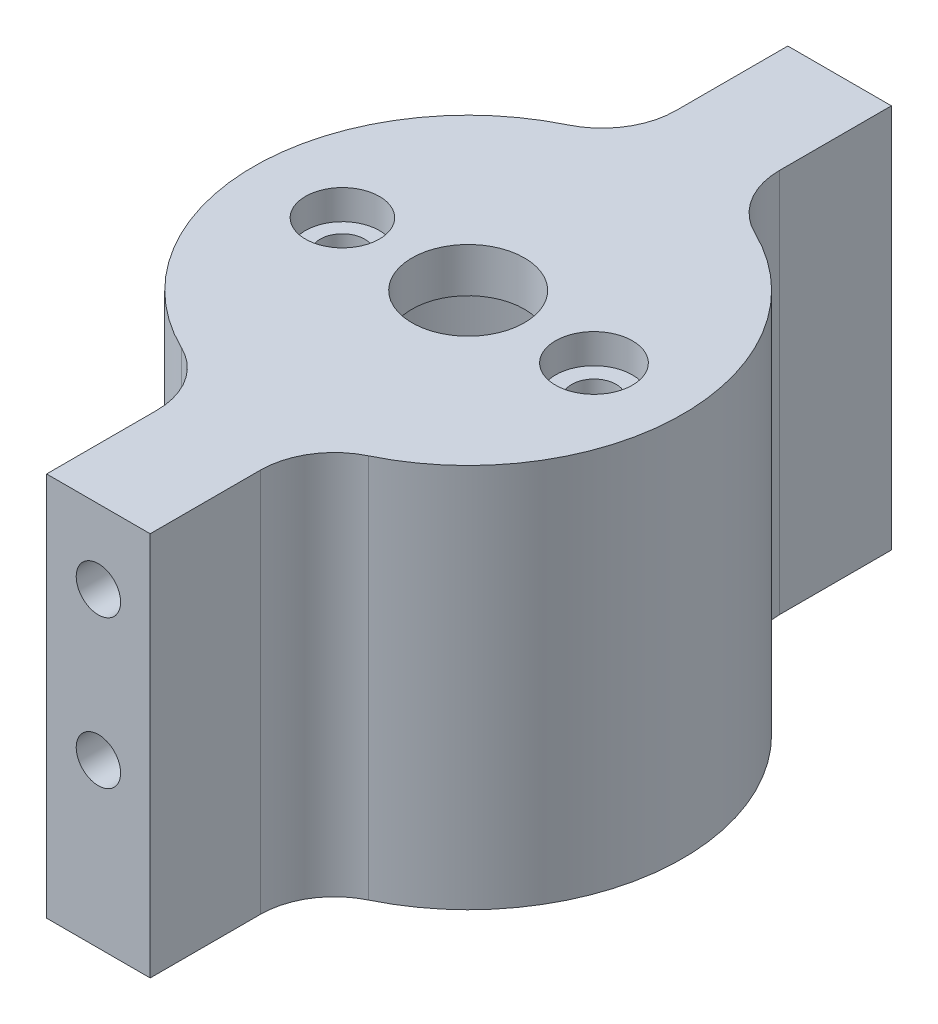
ISO-10303-21;
HEADER;
FILE_DESCRIPTION(('STEP AP214'),'2;1');
FILE_NAME('part.step','',(''),(''),'','','');
FILE_SCHEMA(('AUTOMOTIVE_DESIGN { 1 0 10303 214 1 1 1 1 }'));
ENDSEC;
DATA;
#1=APPLICATION_CONTEXT('core data for automotive mechanical design processes');
#2=APPLICATION_PROTOCOL_DEFINITION('international standard','automotive_design',2000,#1);
#3=PRODUCT_CONTEXT('',#1,'mechanical');
#4=PRODUCT('Part','Part','',(#3));
#5=PRODUCT_RELATED_PRODUCT_CATEGORY('part','',(#4));
#6=PRODUCT_DEFINITION_FORMATION('','',#4);
#7=PRODUCT_DEFINITION_CONTEXT('part definition',#1,'design');
#8=PRODUCT_DEFINITION('design','',#6,#7);
#9=PRODUCT_DEFINITION_SHAPE('','',#8);
#10=(LENGTH_UNIT() NAMED_UNIT(*) SI_UNIT(.MILLI.,.METRE.));
#11=(NAMED_UNIT(*) PLANE_ANGLE_UNIT() SI_UNIT($,.RADIAN.));
#12=(NAMED_UNIT(*) SI_UNIT($,.STERADIAN.) SOLID_ANGLE_UNIT());
#13=UNCERTAINTY_MEASURE_WITH_UNIT(LENGTH_MEASURE(1.E-05),#10,'distance_accuracy_value','');
#14=(GEOMETRIC_REPRESENTATION_CONTEXT(3) GLOBAL_UNCERTAINTY_ASSIGNED_CONTEXT((#13)) GLOBAL_UNIT_ASSIGNED_CONTEXT((#10,
#11,#12)) REPRESENTATION_CONTEXT('',''));
#15=CARTESIAN_POINT('',(0.,0.,0.));
#16=DIRECTION('',(0.,0.,1.));
#17=DIRECTION('',(1.,0.,0.));
#18=AXIS2_PLACEMENT_3D('',#15,#16,#17);
#19=CARTESIAN_POINT('',(0.,2.,0.));
#20=DIRECTION('',(0.,-1.,0.));
#21=DIRECTION('',(0.,0.,1.));
#22=AXIS2_PLACEMENT_3D('',#19,#20,#21);
#23=CYLINDRICAL_SURFACE('',#22,14.5);
#24=CARTESIAN_POINT('',(0.,-23.,0.));
#25=DIRECTION('',(0.,1.,0.));
#26=DIRECTION('',(0.,0.,1.));
#27=AXIS2_PLACEMENT_3D('',#24,#25,#26);
#28=CIRCLE('',#27,14.5);
#29=CARTESIAN_POINT('',(6.32051282051282,-23.,13.0499470376601));
#30=VERTEX_POINT('',#29);
#31=CARTESIAN_POINT('',(6.32051282051281,-23.,-13.0499470376601));
#32=VERTEX_POINT('',#31);
#33=EDGE_CURVE('E214',#30,#32,#28,.T.);
#34=ORIENTED_EDGE('',*,*,#33,.T.);
#35=DIRECTION('',(0.,-1.,0.));
#36=VECTOR('',#35,1.);
#37=CARTESIAN_POINT('',(6.32051282051281,2.,-13.0499470376601));
#38=LINE('',#37,#36);
#39=CARTESIAN_POINT('',(6.32051282051281,3.,-13.0499470376601));
#40=VERTEX_POINT('',#39);
#41=EDGE_CURVE('E247',#40,#32,#38,.T.);
#42=ORIENTED_EDGE('',*,*,#41,.F.);
#43=CARTESIAN_POINT('',(0.,3.,0.));
#44=DIRECTION('',(0.,-1.,0.));
#45=DIRECTION('',(0.,0.,-1.));
#46=AXIS2_PLACEMENT_3D('',#43,#44,#45);
#47=CIRCLE('',#46,14.5);
#48=CARTESIAN_POINT('',(6.32051282051282,3.,13.0499470376601));
#49=VERTEX_POINT('',#48);
#50=EDGE_CURVE('E209',#40,#49,#47,.T.);
#51=ORIENTED_EDGE('',*,*,#50,.T.);
#52=DIRECTION('',(0.,-1.,0.));
#53=VECTOR('',#52,1.);
#54=CARTESIAN_POINT('',(6.32051282051282,2.,13.0499470376601));
#55=LINE('',#54,#53);
#56=EDGE_CURVE('E250',#30,#49,#55,.F.);
#57=ORIENTED_EDGE('',*,*,#56,.F.);
#58=EDGE_LOOP('',(#34,#42,#51,#57));
#59=FACE_BOUND('',#58,.T.);
#60=ADVANCED_FACE('F41',(#59),#23,.T.);
#61=CARTESIAN_POINT('',(-8.5,-0.5,0.));
#62=DIRECTION('',(0.,1.,0.));
#63=DIRECTION('',(0.,0.,-1.));
#64=AXIS2_PLACEMENT_3D('',#61,#62,#63);
#65=CYLINDRICAL_SURFACE('',#64,1.5);
#66=CARTESIAN_POINT('',(-8.5,0.,0.));
#67=DIRECTION('',(0.,-1.,0.));
#68=DIRECTION('',(0.,0.,-1.));
#69=AXIS2_PLACEMENT_3D('',#66,#67,#68);
#70=CIRCLE('',#69,1.5);
#71=CARTESIAN_POINT('',(-8.5,0.,-1.5));
#72=VERTEX_POINT('',#71);
#73=EDGE_CURVE('E227',#72,#72,#70,.T.);
#74=ORIENTED_EDGE('',*,*,#73,.T.);
#75=EDGE_LOOP('',(#74));
#76=FACE_BOUND('',#75,.T.);
#77=CARTESIAN_POINT('',(-8.5,1.,0.));
#78=DIRECTION('',(0.,-1.,0.));
#79=DIRECTION('',(0.,0.,-1.));
#80=AXIS2_PLACEMENT_3D('',#77,#78,#79);
#81=CIRCLE('',#80,1.5);
#82=CARTESIAN_POINT('',(-8.5,1.,-1.5));
#83=VERTEX_POINT('',#82);
#84=EDGE_CURVE('E210',#83,#83,#81,.F.);
#85=ORIENTED_EDGE('',*,*,#84,.T.);
#86=EDGE_LOOP('',(#85));
#87=FACE_BOUND('',#86,.T.);
#88=ADVANCED_FACE('F336',(#76,#87),#65,.F.);
#89=CARTESIAN_POINT('',(8.5,-0.5,0.));
#90=DIRECTION('',(0.,1.,0.));
#91=DIRECTION('',(0.,0.,-1.));
#92=AXIS2_PLACEMENT_3D('',#89,#90,#91);
#93=CYLINDRICAL_SURFACE('',#92,1.5);
#94=CARTESIAN_POINT('',(8.5,0.,0.));
#95=DIRECTION('',(0.,-1.,0.));
#96=DIRECTION('',(0.,0.,-1.));
#97=AXIS2_PLACEMENT_3D('',#94,#95,#96);
#98=CIRCLE('',#97,1.5);
#99=CARTESIAN_POINT('',(8.5,0.,-1.5));
#100=VERTEX_POINT('',#99);
#101=EDGE_CURVE('E230',#100,#100,#98,.T.);
#102=ORIENTED_EDGE('',*,*,#101,.T.);
#103=EDGE_LOOP('',(#102));
#104=FACE_BOUND('',#103,.T.);
#105=CARTESIAN_POINT('',(8.5,1.,0.));
#106=DIRECTION('',(0.,-1.,0.));
#107=DIRECTION('',(0.,0.,-1.));
#108=AXIS2_PLACEMENT_3D('',#105,#106,#107);
#109=CIRCLE('',#108,1.5);
#110=CARTESIAN_POINT('',(8.5,1.,-1.5));
#111=VERTEX_POINT('',#110);
#112=EDGE_CURVE('E197',#111,#111,#109,.F.);
#113=ORIENTED_EDGE('',*,*,#112,.T.);
#114=EDGE_LOOP('',(#113));
#115=FACE_BOUND('',#114,.T.);
#116=ADVANCED_FACE('F341',(#104,#115),#93,.F.);
#117=CARTESIAN_POINT('',(0.,0.,0.));
#118=DIRECTION('',(0.,1.,0.));
#119=DIRECTION('',(0.,0.,-1.));
#120=AXIS2_PLACEMENT_3D('',#117,#118,#119);
#121=PLANE('',#120);
#122=CARTESIAN_POINT('',(0.,0.,0.));
#123=DIRECTION('',(0.,-1.,0.));
#124=DIRECTION('',(0.,0.,-1.));
#125=AXIS2_PLACEMENT_3D('',#122,#123,#124);
#126=CIRCLE('',#125,3.8);
#127=CARTESIAN_POINT('',(0.,0.,-3.8));
#128=VERTEX_POINT('',#127);
#129=EDGE_CURVE('E224',#128,#128,#126,.T.);
#130=ORIENTED_EDGE('',*,*,#129,.F.);
#131=EDGE_LOOP('',(#130));
#132=FACE_BOUND('',#131,.T.);
#133=ORIENTED_EDGE('',*,*,#73,.F.);
#134=EDGE_LOOP('',(#133));
#135=FACE_BOUND('',#134,.T.);
#136=ORIENTED_EDGE('',*,*,#101,.F.);
#137=EDGE_LOOP('',(#136));
#138=FACE_BOUND('',#137,.T.);
#139=CARTESIAN_POINT('',(0.,0.,0.));
#140=DIRECTION('',(0.,1.,0.));
#141=DIRECTION('',(0.,0.,1.));
#142=AXIS2_PLACEMENT_3D('',#139,#140,#141);
#143=CIRCLE('',#142,12.5);
#144=CARTESIAN_POINT('',(0.,0.,12.5));
#145=VERTEX_POINT('',#144);
#146=EDGE_CURVE('E217',#145,#145,#143,.T.);
#147=ORIENTED_EDGE('',*,*,#146,.F.);
#148=EDGE_LOOP('',(#147));
#149=FACE_BOUND('',#148,.T.);
#150=ADVANCED_FACE('F347',(#132,#135,#138,#149),#121,.F.);
#151=CARTESIAN_POINT('',(-6.32051282051282,3.,13.0499470376601));
#152=VERTEX_POINT('',#151);
#153=CARTESIAN_POINT('',(-6.32051282051282,3.,-13.0499470376601));
#154=VERTEX_POINT('',#153);
#155=EDGE_CURVE('E213',#152,#154,#47,.T.);
#156=ORIENTED_EDGE('',*,*,#155,.T.);
#157=DIRECTION('',(0.,-1.,0.));
#158=VECTOR('',#157,1.);
#159=CARTESIAN_POINT('',(-6.32051282051282,2.,-13.0499470376601));
#160=LINE('',#159,#158);
#161=CARTESIAN_POINT('',(-6.32051282051282,-23.,-13.0499470376601));
#162=VERTEX_POINT('',#161);
#163=EDGE_CURVE('E233',#162,#154,#160,.F.);
#164=ORIENTED_EDGE('',*,*,#163,.F.);
#165=CARTESIAN_POINT('',(-6.32051282051282,-23.,13.0499470376601));
#166=VERTEX_POINT('',#165);
#167=EDGE_CURVE('E218',#162,#166,#28,.T.);
#168=ORIENTED_EDGE('',*,*,#167,.T.);
#169=DIRECTION('',(0.,-1.,0.));
#170=VECTOR('',#169,1.);
#171=CARTESIAN_POINT('',(-6.32051282051282,2.,13.0499470376601));
#172=LINE('',#171,#170);
#173=EDGE_CURVE('E240',#152,#166,#172,.T.);
#174=ORIENTED_EDGE('',*,*,#173,.F.);
#175=EDGE_LOOP('',(#156,#164,#168,#174));
#176=FACE_BOUND('',#175,.T.);
#177=ADVANCED_FACE('F281',(#176),#23,.T.);
#178=CARTESIAN_POINT('',(0.,-0.5,0.));
#179=DIRECTION('',(0.,1.,0.));
#180=DIRECTION('',(0.,0.,-1.));
#181=AXIS2_PLACEMENT_3D('',#178,#179,#180);
#182=CYLINDRICAL_SURFACE('',#181,3.8);
#183=ORIENTED_EDGE('',*,*,#129,.T.);
#184=EDGE_LOOP('',(#183));
#185=FACE_BOUND('',#184,.T.);
#186=CARTESIAN_POINT('',(0.,3.,0.));
#187=DIRECTION('',(0.,-1.,0.));
#188=DIRECTION('',(0.,0.,-1.));
#189=AXIS2_PLACEMENT_3D('',#186,#187,#188);
#190=CIRCLE('',#189,3.8);
#191=CARTESIAN_POINT('',(0.,3.,-3.8));
#192=VERTEX_POINT('',#191);
#193=EDGE_CURVE('E206',#192,#192,#190,.T.);
#194=ORIENTED_EDGE('',*,*,#193,.F.);
#195=EDGE_LOOP('',(#194));
#196=FACE_BOUND('',#195,.T.);
#197=ADVANCED_FACE('F346',(#185,#196),#182,.F.);
#198=CARTESIAN_POINT('',(0.,-23.,0.));
#199=DIRECTION('',(0.,-1.,0.));
#200=DIRECTION('',(0.,0.,1.));
#201=AXIS2_PLACEMENT_3D('',#198,#199,#200);
#202=PLANE('',#201);
#203=DIRECTION('',(-1.,0.,0.));
#204=VECTOR('',#203,1.);
#205=CARTESIAN_POINT('',(3.5,-23.,24.99));
#206=LINE('',#205,#204);
#207=CARTESIAN_POINT('',(3.5,-23.,24.99));
#208=VERTEX_POINT('',#207);
#209=CARTESIAN_POINT('',(-3.49999999999999,-23.,24.99));
#210=VERTEX_POINT('',#209);
#211=EDGE_CURVE('E163',#208,#210,#206,.T.);
#212=ORIENTED_EDGE('',*,*,#211,.T.);
#213=DIRECTION('',(0.,0.,1.));
#214=VECTOR('',#213,1.);
#215=CARTESIAN_POINT('',(-3.5,-23.,25.1));
#216=LINE('',#215,#214);
#217=CARTESIAN_POINT('',(-3.5,-23.,17.5499287747842));
#218=VERTEX_POINT('',#217);
#219=EDGE_CURVE('E181',#218,#210,#216,.T.);
#220=ORIENTED_EDGE('',*,*,#219,.F.);
#221=CARTESIAN_POINT('',(-8.49999999999999,-23.,17.5499287747842));
#222=DIRECTION('',(0.,1.,0.));
#223=DIRECTION('',(0.,0.,1.));
#224=AXIS2_PLACEMENT_3D('',#221,#222,#223);
#225=CIRCLE('',#224,5.);
#226=EDGE_CURVE('E256',#166,#218,#225,.F.);
#227=ORIENTED_EDGE('',*,*,#226,.F.);
#228=ORIENTED_EDGE('',*,*,#167,.F.);
#229=CARTESIAN_POINT('',(-8.49999999999999,-23.,-17.5499287747842));
#230=DIRECTION('',(0.,1.,0.));
#231=DIRECTION('',(0.,0.,1.));
#232=AXIS2_PLACEMENT_3D('',#229,#230,#231);
#233=CIRCLE('',#232,5.);
#234=CARTESIAN_POINT('',(-3.5,-23.,-17.5499287747842));
#235=VERTEX_POINT('',#234);
#236=EDGE_CURVE('E49',#235,#162,#233,.F.);
#237=ORIENTED_EDGE('',*,*,#236,.F.);
#238=DIRECTION('',(0.,0.,1.));
#239=VECTOR('',#238,1.);
#240=CARTESIAN_POINT('',(-3.5,-23.,-25.1));
#241=LINE('',#240,#239);
#242=CARTESIAN_POINT('',(-3.5,-23.,-25.1));
#243=VERTEX_POINT('',#242);
#244=EDGE_CURVE('E156',#243,#235,#241,.T.);
#245=ORIENTED_EDGE('',*,*,#244,.F.);
#246=DIRECTION('',(-1.,0.,0.));
#247=VECTOR('',#246,1.);
#248=CARTESIAN_POINT('',(3.5,-23.,-25.1));
#249=LINE('',#248,#247);
#250=CARTESIAN_POINT('',(3.5,-23.,-25.1));
#251=VERTEX_POINT('',#250);
#252=EDGE_CURVE('E133',#251,#243,#249,.T.);
#253=ORIENTED_EDGE('',*,*,#252,.F.);
#254=DIRECTION('',(0.,0.,1.));
#255=VECTOR('',#254,1.);
#256=CARTESIAN_POINT('',(3.5,-23.,-25.1));
#257=LINE('',#256,#255);
#258=CARTESIAN_POINT('',(3.49999999999998,-23.,-17.5499287747843));
#259=VERTEX_POINT('',#258);
#260=EDGE_CURVE('E153',#251,#259,#257,.T.);
#261=ORIENTED_EDGE('',*,*,#260,.T.);
#262=CARTESIAN_POINT('',(8.49999999999998,-23.,-17.5499287747842));
#263=DIRECTION('',(0.,1.,0.));
#264=DIRECTION('',(0.,0.,1.));
#265=AXIS2_PLACEMENT_3D('',#262,#263,#264);
#266=CIRCLE('',#265,5.);
#267=EDGE_CURVE('E266',#32,#259,#266,.F.);
#268=ORIENTED_EDGE('',*,*,#267,.F.);
#269=ORIENTED_EDGE('',*,*,#33,.F.);
#270=CARTESIAN_POINT('',(8.49999999999999,-23.,17.5499287747842));
#271=DIRECTION('',(0.,1.,0.));
#272=DIRECTION('',(0.,0.,1.));
#273=AXIS2_PLACEMENT_3D('',#270,#271,#272);
#274=CIRCLE('',#273,5.);
#275=CARTESIAN_POINT('',(3.5,-23.,17.5499287747842));
#276=VERTEX_POINT('',#275);
#277=EDGE_CURVE('E261',#276,#30,#274,.F.);
#278=ORIENTED_EDGE('',*,*,#277,.F.);
#279=DIRECTION('',(0.,0.,-1.));
#280=VECTOR('',#279,1.);
#281=CARTESIAN_POINT('',(3.5,-23.,25.1));
#282=LINE('',#281,#280);
#283=EDGE_CURVE('E186',#208,#276,#282,.T.);
#284=ORIENTED_EDGE('',*,*,#283,.F.);
#285=EDGE_LOOP('',(#212,#220,#227,#228,#237,#245,#253,#261,#268,#269,#278,#284));
#286=FACE_BOUND('',#285,.T.);
#287=CARTESIAN_POINT('',(0.,-23.,0.));
#288=DIRECTION('',(0.,1.,0.));
#289=DIRECTION('',(0.,0.,1.));
#290=AXIS2_PLACEMENT_3D('',#287,#288,#289);
#291=CIRCLE('',#290,12.5);
#292=CARTESIAN_POINT('',(0.,-23.,12.5));
#293=VERTEX_POINT('',#292);
#294=EDGE_CURVE('E221',#293,#293,#291,.T.);
#295=ORIENTED_EDGE('',*,*,#294,.T.);
#296=EDGE_LOOP('',(#295));
#297=FACE_BOUND('',#296,.T.);
#298=ADVANCED_FACE('F276',(#286,#297),#202,.T.);
#299=CARTESIAN_POINT('',(0.,-23.,0.));
#300=DIRECTION('',(0.,1.,0.));
#301=DIRECTION('',(0.,0.,-1.));
#302=AXIS2_PLACEMENT_3D('',#299,#300,#301);
#303=CYLINDRICAL_SURFACE('',#302,12.5);
#304=ORIENTED_EDGE('',*,*,#294,.F.);
#305=EDGE_LOOP('',(#304));
#306=FACE_BOUND('',#305,.T.);
#307=ORIENTED_EDGE('',*,*,#146,.T.);
#308=EDGE_LOOP('',(#307));
#309=FACE_BOUND('',#308,.T.);
#310=ADVANCED_FACE('F365',(#306,#309),#303,.F.);
#311=CARTESIAN_POINT('',(0.,3.,0.));
#312=DIRECTION('',(0.,1.,0.));
#313=DIRECTION('',(0.,0.,-1.));
#314=AXIS2_PLACEMENT_3D('',#311,#312,#313);
#315=PLANE('',#314);
#316=DIRECTION('',(-1.,0.,0.));
#317=VECTOR('',#316,1.);
#318=CARTESIAN_POINT('',(3.5,3.00000000000001,24.99));
#319=LINE('',#318,#317);
#320=CARTESIAN_POINT('',(3.5,3.00000000000001,24.99));
#321=VERTEX_POINT('',#320);
#322=CARTESIAN_POINT('',(-3.49999999999999,3.00000000000001,24.99));
#323=VERTEX_POINT('',#322);
#324=EDGE_CURVE('E176',#321,#323,#319,.T.);
#325=ORIENTED_EDGE('',*,*,#324,.F.);
#326=DIRECTION('',(0.,0.,-1.));
#327=VECTOR('',#326,1.);
#328=CARTESIAN_POINT('',(3.5,3.00000000000001,25.1));
#329=LINE('',#328,#327);
#330=CARTESIAN_POINT('',(3.5,3.00000000000001,17.5499287747842));
#331=VERTEX_POINT('',#330);
#332=EDGE_CURVE('E185',#321,#331,#329,.T.);
#333=ORIENTED_EDGE('',*,*,#332,.T.);
#334=CARTESIAN_POINT('',(8.49999999999999,3.,17.5499287747842));
#335=DIRECTION('',(0.,-1.,0.));
#336=DIRECTION('',(0.,0.,-1.));
#337=AXIS2_PLACEMENT_3D('',#334,#335,#336);
#338=CIRCLE('',#337,5.);
#339=EDGE_CURVE('E263',#49,#331,#338,.F.);
#340=ORIENTED_EDGE('',*,*,#339,.F.);
#341=ORIENTED_EDGE('',*,*,#50,.F.);
#342=CARTESIAN_POINT('',(8.49999999999998,3.,-17.5499287747842));
#343=DIRECTION('',(0.,-1.,0.));
#344=DIRECTION('',(0.,0.,-1.));
#345=AXIS2_PLACEMENT_3D('',#342,#343,#344);
#346=CIRCLE('',#345,5.);
#347=CARTESIAN_POINT('',(3.49999999999998,3.00000000000001,-17.5499287747843));
#348=VERTEX_POINT('',#347);
#349=EDGE_CURVE('E269',#348,#40,#346,.F.);
#350=ORIENTED_EDGE('',*,*,#349,.F.);
#351=DIRECTION('',(0.,0.,1.));
#352=VECTOR('',#351,1.);
#353=CARTESIAN_POINT('',(3.5,3.00000000000001,-25.1));
#354=LINE('',#353,#352);
#355=CARTESIAN_POINT('',(3.5,3.00000000000001,-25.1));
#356=VERTEX_POINT('',#355);
#357=EDGE_CURVE('E142',#356,#348,#354,.T.);
#358=ORIENTED_EDGE('',*,*,#357,.F.);
#359=DIRECTION('',(-1.,0.,0.));
#360=VECTOR('',#359,1.);
#361=CARTESIAN_POINT('',(3.5,3.00000000000001,-25.1));
#362=LINE('',#361,#360);
#363=CARTESIAN_POINT('',(-3.5,3.00000000000001,-25.1));
#364=VERTEX_POINT('',#363);
#365=EDGE_CURVE('E130',#356,#364,#362,.T.);
#366=ORIENTED_EDGE('',*,*,#365,.T.);
#367=DIRECTION('',(0.,0.,1.));
#368=VECTOR('',#367,1.);
#369=CARTESIAN_POINT('',(-3.5,3.00000000000001,-25.1));
#370=LINE('',#369,#368);
#371=CARTESIAN_POINT('',(-3.5,3.00000000000001,-17.5499287747842));
#372=VERTEX_POINT('',#371);
#373=EDGE_CURVE('E139',#364,#372,#370,.T.);
#374=ORIENTED_EDGE('',*,*,#373,.T.);
#375=CARTESIAN_POINT('',(-8.49999999999999,3.,-17.5499287747842));
#376=DIRECTION('',(0.,-1.,0.));
#377=DIRECTION('',(0.,0.,-1.));
#378=AXIS2_PLACEMENT_3D('',#375,#376,#377);
#379=CIRCLE('',#378,5.);
#380=EDGE_CURVE('E11',#154,#372,#379,.F.);
#381=ORIENTED_EDGE('',*,*,#380,.F.);
#382=ORIENTED_EDGE('',*,*,#155,.F.);
#383=CARTESIAN_POINT('',(-8.49999999999999,3.,17.5499287747842));
#384=DIRECTION('',(0.,-1.,0.));
#385=DIRECTION('',(0.,0.,-1.));
#386=AXIS2_PLACEMENT_3D('',#383,#384,#385);
#387=CIRCLE('',#386,5.);
#388=CARTESIAN_POINT('',(-3.5,3.00000000000001,17.5499287747842));
#389=VERTEX_POINT('',#388);
#390=EDGE_CURVE('E259',#389,#152,#387,.F.);
#391=ORIENTED_EDGE('',*,*,#390,.F.);
#392=DIRECTION('',(0.,0.,1.));
#393=VECTOR('',#392,1.);
#394=CARTESIAN_POINT('',(-3.5,3.00000000000001,25.1));
#395=LINE('',#394,#393);
#396=EDGE_CURVE('E182',#389,#323,#395,.T.);
#397=ORIENTED_EDGE('',*,*,#396,.T.);
#398=EDGE_LOOP('',(#325,#333,#340,#341,#350,#358,#366,#374,#381,#382,#391,#397));
#399=FACE_BOUND('',#398,.T.);
#400=CARTESIAN_POINT('',(8.5,3.,0.));
#401=DIRECTION('',(0.,-1.,0.));
#402=DIRECTION('',(0.,0.,-1.));
#403=AXIS2_PLACEMENT_3D('',#400,#401,#402);
#404=CIRCLE('',#403,2.6);
#405=CARTESIAN_POINT('',(8.5,3.,-2.6));
#406=VERTEX_POINT('',#405);
#407=EDGE_CURVE('E198',#406,#406,#404,.T.);
#408=ORIENTED_EDGE('',*,*,#407,.T.);
#409=EDGE_LOOP('',(#408));
#410=FACE_BOUND('',#409,.T.);
#411=CARTESIAN_POINT('',(-8.5,3.,0.));
#412=DIRECTION('',(0.,-1.,0.));
#413=DIRECTION('',(0.,0.,-1.));
#414=AXIS2_PLACEMENT_3D('',#411,#412,#413);
#415=CIRCLE('',#414,2.5);
#416=CARTESIAN_POINT('',(-8.5,3.,-2.5));
#417=VERTEX_POINT('',#416);
#418=EDGE_CURVE('E201',#417,#417,#415,.T.);
#419=ORIENTED_EDGE('',*,*,#418,.T.);
#420=EDGE_LOOP('',(#419));
#421=FACE_BOUND('',#420,.T.);
#422=ORIENTED_EDGE('',*,*,#193,.T.);
#423=EDGE_LOOP('',(#422));
#424=FACE_BOUND('',#423,.T.);
#425=ADVANCED_FACE('F145',(#399,#410,#421,#424),#315,.T.);
#426=CARTESIAN_POINT('',(-8.5,1.,0.));
#427=DIRECTION('',(0.,1.,0.));
#428=DIRECTION('',(0.,0.,-1.));
#429=AXIS2_PLACEMENT_3D('',#426,#427,#428);
#430=PLANE('',#429);
#431=CARTESIAN_POINT('',(-8.5,1.,0.));
#432=DIRECTION('',(0.,-1.,0.));
#433=DIRECTION('',(0.,0.,-1.));
#434=AXIS2_PLACEMENT_3D('',#431,#432,#433);
#435=CIRCLE('',#434,2.5);
#436=CARTESIAN_POINT('',(-8.5,1.,-2.5));
#437=VERTEX_POINT('',#436);
#438=EDGE_CURVE('E189',#437,#437,#435,.T.);
#439=ORIENTED_EDGE('',*,*,#438,.F.);
#440=EDGE_LOOP('',(#439));
#441=FACE_BOUND('',#440,.T.);
#442=ORIENTED_EDGE('',*,*,#84,.F.);
#443=EDGE_LOOP('',(#442));
#444=FACE_BOUND('',#443,.T.);
#445=ADVANCED_FACE('F371',(#441,#444),#430,.T.);
#446=CARTESIAN_POINT('',(-8.5,1.,0.));
#447=DIRECTION('',(0.,1.,0.));
#448=DIRECTION('',(0.,0.,-1.));
#449=AXIS2_PLACEMENT_3D('',#446,#447,#448);
#450=CYLINDRICAL_SURFACE('',#449,2.5);
#451=ORIENTED_EDGE('',*,*,#438,.T.);
#452=EDGE_LOOP('',(#451));
#453=FACE_BOUND('',#452,.T.);
#454=ORIENTED_EDGE('',*,*,#418,.F.);
#455=EDGE_LOOP('',(#454));
#456=FACE_BOUND('',#455,.T.);
#457=ADVANCED_FACE('F374',(#453,#456),#450,.F.);
#458=CARTESIAN_POINT('',(8.5,1.,0.));
#459=DIRECTION('',(0.,1.,0.));
#460=DIRECTION('',(0.,0.,-1.));
#461=AXIS2_PLACEMENT_3D('',#458,#459,#460);
#462=PLANE('',#461);
#463=CARTESIAN_POINT('',(8.5,1.,0.));
#464=DIRECTION('',(0.,-1.,0.));
#465=DIRECTION('',(0.,0.,-1.));
#466=AXIS2_PLACEMENT_3D('',#463,#464,#465);
#467=CIRCLE('',#466,2.6);
#468=CARTESIAN_POINT('',(8.5,1.,-2.6));
#469=VERTEX_POINT('',#468);
#470=EDGE_CURVE('E194',#469,#469,#467,.T.);
#471=ORIENTED_EDGE('',*,*,#470,.F.);
#472=EDGE_LOOP('',(#471));
#473=FACE_BOUND('',#472,.T.);
#474=ORIENTED_EDGE('',*,*,#112,.F.);
#475=EDGE_LOOP('',(#474));
#476=FACE_BOUND('',#475,.T.);
#477=ADVANCED_FACE('F378',(#473,#476),#462,.T.);
#478=CARTESIAN_POINT('',(8.5,1.,0.));
#479=DIRECTION('',(0.,1.,0.));
#480=DIRECTION('',(0.,0.,-1.));
#481=AXIS2_PLACEMENT_3D('',#478,#479,#480);
#482=CYLINDRICAL_SURFACE('',#481,2.6);
#483=ORIENTED_EDGE('',*,*,#470,.T.);
#484=EDGE_LOOP('',(#483));
#485=FACE_BOUND('',#484,.T.);
#486=ORIENTED_EDGE('',*,*,#407,.F.);
#487=EDGE_LOOP('',(#486));
#488=FACE_BOUND('',#487,.T.);
#489=ADVANCED_FACE('F380',(#485,#488),#482,.F.);
#490=CARTESIAN_POINT('',(-3.5,3.00000000000001,25.1));
#491=DIRECTION('',(-1.,0.,0.));
#492=DIRECTION('',(0.,0.,-1.));
#493=AXIS2_PLACEMENT_3D('',#490,#491,#492);
#494=PLANE('',#493);
#495=ORIENTED_EDGE('',*,*,#219,.T.);
#496=DIRECTION('',(0.,-1.,0.));
#497=VECTOR('',#496,1.);
#498=CARTESIAN_POINT('',(-3.49999999999999,3.00000000000001,24.99));
#499=LINE('',#498,#497);
#500=EDGE_CURVE('E174',#323,#210,#499,.T.);
#501=ORIENTED_EDGE('',*,*,#500,.F.);
#502=ORIENTED_EDGE('',*,*,#396,.F.);
#503=DIRECTION('',(0.,-1.,0.));
#504=VECTOR('',#503,1.);
#505=CARTESIAN_POINT('',(-3.5,3.00000000000001,17.5499287747842));
#506=LINE('',#505,#504);
#507=EDGE_CURVE('E243',#218,#389,#506,.F.);
#508=ORIENTED_EDGE('',*,*,#507,.F.);
#509=EDGE_LOOP('',(#495,#501,#502,#508));
#510=FACE_BOUND('',#509,.T.);
#511=ADVANCED_FACE('F288',(#510),#494,.T.);
#512=CARTESIAN_POINT('',(3.5,3.00000000000001,25.1));
#513=DIRECTION('',(1.,0.,0.));
#514=DIRECTION('',(0.,0.,1.));
#515=AXIS2_PLACEMENT_3D('',#512,#513,#514);
#516=PLANE('',#515);
#517=ORIENTED_EDGE('',*,*,#332,.F.);
#518=DIRECTION('',(0.,-1.,0.));
#519=VECTOR('',#518,1.);
#520=CARTESIAN_POINT('',(3.5,3.00000000000001,24.99));
#521=LINE('',#520,#519);
#522=EDGE_CURVE('E179',#321,#208,#521,.T.);
#523=ORIENTED_EDGE('',*,*,#522,.T.);
#524=ORIENTED_EDGE('',*,*,#283,.T.);
#525=DIRECTION('',(0.,-1.,0.));
#526=VECTOR('',#525,1.);
#527=CARTESIAN_POINT('',(3.5,3.00000000000001,17.5499287747842));
#528=LINE('',#527,#526);
#529=EDGE_CURVE('E245',#331,#276,#528,.T.);
#530=ORIENTED_EDGE('',*,*,#529,.F.);
#531=EDGE_LOOP('',(#517,#523,#524,#530));
#532=FACE_BOUND('',#531,.T.);
#533=ADVANCED_FACE('F295',(#532),#516,.T.);
#534=CARTESIAN_POINT('',(0.,0.,24.99));
#535=DIRECTION('',(0.,0.,-1.));
#536=DIRECTION('',(1.,0.,0.));
#537=AXIS2_PLACEMENT_3D('',#534,#535,#536);
#538=PLANE('',#537);
#539=CARTESIAN_POINT('',(0.,-1.99999999999999,24.99));
#540=DIRECTION('',(0.,0.,-1.));
#541=DIRECTION('',(-1.,0.,0.));
#542=AXIS2_PLACEMENT_3D('',#539,#540,#541);
#543=CIRCLE('',#542,1.5);
#544=CARTESIAN_POINT('',(-1.5,-1.99999999999999,24.99));
#545=VERTEX_POINT('',#544);
#546=EDGE_CURVE('E164',#545,#545,#543,.T.);
#547=ORIENTED_EDGE('',*,*,#546,.T.);
#548=EDGE_LOOP('',(#547));
#549=FACE_BOUND('',#548,.T.);
#550=CARTESIAN_POINT('',(0.,-12.,24.99));
#551=DIRECTION('',(0.,0.,-1.));
#552=DIRECTION('',(-1.,0.,0.));
#553=AXIS2_PLACEMENT_3D('',#550,#551,#552);
#554=CIRCLE('',#553,1.5);
#555=CARTESIAN_POINT('',(-1.5,-12.,24.99));
#556=VERTEX_POINT('',#555);
#557=EDGE_CURVE('E167',#556,#556,#554,.T.);
#558=ORIENTED_EDGE('',*,*,#557,.T.);
#559=EDGE_LOOP('',(#558));
#560=FACE_BOUND('',#559,.T.);
#561=ORIENTED_EDGE('',*,*,#211,.F.);
#562=ORIENTED_EDGE('',*,*,#522,.F.);
#563=ORIENTED_EDGE('',*,*,#324,.T.);
#564=ORIENTED_EDGE('',*,*,#500,.T.);
#565=EDGE_LOOP('',(#561,#562,#563,#564));
#566=FACE_BOUND('',#565,.T.);
#567=ADVANCED_FACE('F291',(#549,#560,#566),#538,.F.);
#568=CARTESIAN_POINT('',(0.,-12.,18.99));
#569=DIRECTION('',(0.,0.,1.));
#570=DIRECTION('',(-1.,0.,0.));
#571=AXIS2_PLACEMENT_3D('',#568,#569,#570);
#572=CYLINDRICAL_SURFACE('',#571,1.5);
#573=CARTESIAN_POINT('',(0.,-12.,18.99));
#574=DIRECTION('',(0.,0.,-1.));
#575=DIRECTION('',(-1.,0.,0.));
#576=AXIS2_PLACEMENT_3D('',#573,#574,#575);
#577=CIRCLE('',#576,1.5);
#578=CARTESIAN_POINT('',(-1.5,-12.,18.99));
#579=VERTEX_POINT('',#578);
#580=EDGE_CURVE('E135',#579,#579,#577,.T.);
#581=ORIENTED_EDGE('',*,*,#580,.T.);
#582=EDGE_LOOP('',(#581));
#583=FACE_BOUND('',#582,.T.);
#584=ORIENTED_EDGE('',*,*,#557,.F.);
#585=EDGE_LOOP('',(#584));
#586=FACE_BOUND('',#585,.T.);
#587=ADVANCED_FACE('F393',(#583,#586),#572,.F.);
#588=CARTESIAN_POINT('',(0.,-12.,18.99));
#589=DIRECTION('',(0.,0.,1.));
#590=DIRECTION('',(-1.,0.,0.));
#591=AXIS2_PLACEMENT_3D('',#588,#589,#590);
#592=PLANE('',#591);
#593=ORIENTED_EDGE('',*,*,#580,.F.);
#594=EDGE_LOOP('',(#593));
#595=FACE_BOUND('',#594,.T.);
#596=ADVANCED_FACE('F395',(#595),#592,.T.);
#597=CARTESIAN_POINT('',(0.,-1.99999999999999,18.99));
#598=DIRECTION('',(0.,0.,1.));
#599=DIRECTION('',(-1.,0.,0.));
#600=AXIS2_PLACEMENT_3D('',#597,#598,#599);
#601=CYLINDRICAL_SURFACE('',#600,1.5);
#602=CARTESIAN_POINT('',(0.,-1.99999999999999,18.99));
#603=DIRECTION('',(0.,0.,-1.));
#604=DIRECTION('',(-1.,0.,0.));
#605=AXIS2_PLACEMENT_3D('',#602,#603,#604);
#606=CIRCLE('',#605,1.5);
#607=CARTESIAN_POINT('',(-1.5,-1.99999999999999,18.99));
#608=VERTEX_POINT('',#607);
#609=EDGE_CURVE('E160',#608,#608,#606,.T.);
#610=ORIENTED_EDGE('',*,*,#609,.T.);
#611=EDGE_LOOP('',(#610));
#612=FACE_BOUND('',#611,.T.);
#613=ORIENTED_EDGE('',*,*,#546,.F.);
#614=EDGE_LOOP('',(#613));
#615=FACE_BOUND('',#614,.T.);
#616=ADVANCED_FACE('F398',(#612,#615),#601,.F.);
#617=CARTESIAN_POINT('',(0.,-1.99999999999999,18.99));
#618=DIRECTION('',(0.,0.,1.));
#619=DIRECTION('',(-1.,0.,0.));
#620=AXIS2_PLACEMENT_3D('',#617,#618,#619);
#621=PLANE('',#620);
#622=ORIENTED_EDGE('',*,*,#609,.F.);
#623=EDGE_LOOP('',(#622));
#624=FACE_BOUND('',#623,.T.);
#625=ADVANCED_FACE('F405',(#624),#621,.T.);
#626=CARTESIAN_POINT('',(3.5,3.00000000000001,-25.1));
#627=DIRECTION('',(-1.,0.,0.));
#628=DIRECTION('',(0.,0.,-1.));
#629=AXIS2_PLACEMENT_3D('',#626,#627,#628);
#630=PLANE('',#629);
#631=ORIENTED_EDGE('',*,*,#260,.F.);
#632=DIRECTION('',(0.,-1.,0.));
#633=VECTOR('',#632,1.);
#634=CARTESIAN_POINT('',(3.5,3.00000000000001,-25.1));
#635=LINE('',#634,#633);
#636=EDGE_CURVE('E136',#356,#251,#635,.T.);
#637=ORIENTED_EDGE('',*,*,#636,.F.);
#638=ORIENTED_EDGE('',*,*,#357,.T.);
#639=DIRECTION('',(0.,1.,0.));
#640=VECTOR('',#639,1.);
#641=CARTESIAN_POINT('',(3.49999999999998,3.,-17.5499287747843));
#642=LINE('',#641,#640);
#643=EDGE_CURVE('E253',#259,#348,#642,.T.);
#644=ORIENTED_EDGE('',*,*,#643,.F.);
#645=EDGE_LOOP('',(#631,#637,#638,#644));
#646=FACE_BOUND('',#645,.T.);
#647=ADVANCED_FACE('F308',(#646),#630,.F.);
#648=CARTESIAN_POINT('',(-3.5,3.00000000000001,-25.1));
#649=DIRECTION('',(-1.,0.,0.));
#650=DIRECTION('',(0.,0.,-1.));
#651=AXIS2_PLACEMENT_3D('',#648,#649,#650);
#652=PLANE('',#651);
#653=ORIENTED_EDGE('',*,*,#373,.F.);
#654=DIRECTION('',(0.,-1.,0.));
#655=VECTOR('',#654,1.);
#656=CARTESIAN_POINT('',(-3.5,3.00000000000001,-25.1));
#657=LINE('',#656,#655);
#658=EDGE_CURVE('E127',#364,#243,#657,.T.);
#659=ORIENTED_EDGE('',*,*,#658,.T.);
#660=ORIENTED_EDGE('',*,*,#244,.T.);
#661=DIRECTION('',(0.,-1.,0.));
#662=VECTOR('',#661,1.);
#663=CARTESIAN_POINT('',(-3.5,3.00000000000001,-17.5499287747842));
#664=LINE('',#663,#662);
#665=EDGE_CURVE('E56',#372,#235,#664,.T.);
#666=ORIENTED_EDGE('',*,*,#665,.F.);
#667=EDGE_LOOP('',(#653,#659,#660,#666));
#668=FACE_BOUND('',#667,.T.);
#669=ADVANCED_FACE('F140',(#668),#652,.T.);
#670=CARTESIAN_POINT('',(3.5,3.00000000000001,-25.1));
#671=DIRECTION('',(0.,0.,-1.));
#672=DIRECTION('',(1.,0.,0.));
#673=AXIS2_PLACEMENT_3D('',#670,#671,#672);
#674=PLANE('',#673);
#675=CARTESIAN_POINT('',(0.,-1.99999999999999,-25.1));
#676=DIRECTION('',(0.,0.,1.));
#677=DIRECTION('',(1.,0.,0.));
#678=AXIS2_PLACEMENT_3D('',#675,#676,#677);
#679=CIRCLE('',#678,1.5);
#680=CARTESIAN_POINT('',(1.5,-1.99999999999999,-25.1));
#681=VERTEX_POINT('',#680);
#682=EDGE_CURVE('E316',#681,#681,#679,.T.);
#683=ORIENTED_EDGE('',*,*,#682,.T.);
#684=EDGE_LOOP('',(#683));
#685=FACE_BOUND('',#684,.T.);
#686=CARTESIAN_POINT('',(0.,-12.,-25.1));
#687=DIRECTION('',(0.,0.,1.));
#688=DIRECTION('',(1.,0.,0.));
#689=AXIS2_PLACEMENT_3D('',#686,#687,#688);
#690=CIRCLE('',#689,1.5);
#691=CARTESIAN_POINT('',(1.5,-12.,-25.1));
#692=VERTEX_POINT('',#691);
#693=EDGE_CURVE('E313',#692,#692,#690,.T.);
#694=ORIENTED_EDGE('',*,*,#693,.T.);
#695=EDGE_LOOP('',(#694));
#696=FACE_BOUND('',#695,.T.);
#697=ORIENTED_EDGE('',*,*,#252,.T.);
#698=ORIENTED_EDGE('',*,*,#658,.F.);
#699=ORIENTED_EDGE('',*,*,#365,.F.);
#700=ORIENTED_EDGE('',*,*,#636,.T.);
#701=EDGE_LOOP('',(#697,#698,#699,#700));
#702=FACE_BOUND('',#701,.T.);
#703=ADVANCED_FACE('F128',(#685,#696,#702),#674,.T.);
#704=CARTESIAN_POINT('',(0.,-12.,-20.1));
#705=DIRECTION('',(0.,0.,-1.));
#706=DIRECTION('',(1.,0.,0.));
#707=AXIS2_PLACEMENT_3D('',#704,#705,#706);
#708=CYLINDRICAL_SURFACE('',#707,1.5);
#709=CARTESIAN_POINT('',(0.,-12.,-20.1));
#710=DIRECTION('',(0.,0.,1.));
#711=DIRECTION('',(1.,0.,0.));
#712=AXIS2_PLACEMENT_3D('',#709,#710,#711);
#713=CIRCLE('',#712,1.5);
#714=CARTESIAN_POINT('',(1.5,-12.,-20.1));
#715=VERTEX_POINT('',#714);
#716=EDGE_CURVE('E310',#715,#715,#713,.T.);
#717=ORIENTED_EDGE('',*,*,#716,.T.);
#718=EDGE_LOOP('',(#717));
#719=FACE_BOUND('',#718,.T.);
#720=ORIENTED_EDGE('',*,*,#693,.F.);
#721=EDGE_LOOP('',(#720));
#722=FACE_BOUND('',#721,.T.);
#723=ADVANCED_FACE('F416',(#719,#722),#708,.F.);
#724=CARTESIAN_POINT('',(0.,-12.,-20.1));
#725=DIRECTION('',(0.,0.,-1.));
#726=DIRECTION('',(1.,0.,0.));
#727=AXIS2_PLACEMENT_3D('',#724,#725,#726);
#728=PLANE('',#727);
#729=ORIENTED_EDGE('',*,*,#716,.F.);
#730=EDGE_LOOP('',(#729));
#731=FACE_BOUND('',#730,.T.);
#732=ADVANCED_FACE('F333',(#731),#728,.T.);
#733=CARTESIAN_POINT('',(0.,-1.99999999999999,-20.1));
#734=DIRECTION('',(0.,0.,-1.));
#735=DIRECTION('',(1.,0.,0.));
#736=AXIS2_PLACEMENT_3D('',#733,#734,#735);
#737=CYLINDRICAL_SURFACE('',#736,1.5);
#738=CARTESIAN_POINT('',(0.,-1.99999999999999,-20.1));
#739=DIRECTION('',(0.,0.,1.));
#740=DIRECTION('',(1.,0.,0.));
#741=AXIS2_PLACEMENT_3D('',#738,#739,#740);
#742=CIRCLE('',#741,1.5);
#743=CARTESIAN_POINT('',(1.5,-1.99999999999999,-20.1));
#744=VERTEX_POINT('',#743);
#745=EDGE_CURVE('E157',#744,#744,#742,.T.);
#746=ORIENTED_EDGE('',*,*,#745,.T.);
#747=EDGE_LOOP('',(#746));
#748=FACE_BOUND('',#747,.T.);
#749=ORIENTED_EDGE('',*,*,#682,.F.);
#750=EDGE_LOOP('',(#749));
#751=FACE_BOUND('',#750,.T.);
#752=ADVANCED_FACE('F322',(#748,#751),#737,.F.);
#753=CARTESIAN_POINT('',(0.,-1.99999999999999,-20.1));
#754=DIRECTION('',(0.,0.,-1.));
#755=DIRECTION('',(1.,0.,0.));
#756=AXIS2_PLACEMENT_3D('',#753,#754,#755);
#757=PLANE('',#756);
#758=ORIENTED_EDGE('',*,*,#745,.F.);
#759=EDGE_LOOP('',(#758));
#760=FACE_BOUND('',#759,.T.);
#761=ADVANCED_FACE('F325',(#760),#757,.T.);
#762=CARTESIAN_POINT('',(-8.49999999999999,2.,17.5499287747842));
#763=DIRECTION('',(0.,-1.,0.));
#764=DIRECTION('',(0.,0.,1.));
#765=AXIS2_PLACEMENT_3D('',#762,#763,#764);
#766=CYLINDRICAL_SURFACE('',#765,5.);
#767=ORIENTED_EDGE('',*,*,#390,.T.);
#768=ORIENTED_EDGE('',*,*,#173,.T.);
#769=ORIENTED_EDGE('',*,*,#226,.T.);
#770=ORIENTED_EDGE('',*,*,#507,.T.);
#771=EDGE_LOOP('',(#767,#768,#769,#770));
#772=FACE_BOUND('',#771,.T.);
#773=ADVANCED_FACE('F286',(#772),#766,.F.);
#774=CARTESIAN_POINT('',(8.49999999999999,2.,17.5499287747842));
#775=DIRECTION('',(0.,-1.,0.));
#776=DIRECTION('',(0.,0.,1.));
#777=AXIS2_PLACEMENT_3D('',#774,#775,#776);
#778=CYLINDRICAL_SURFACE('',#777,5.);
#779=ORIENTED_EDGE('',*,*,#339,.T.);
#780=ORIENTED_EDGE('',*,*,#529,.T.);
#781=ORIENTED_EDGE('',*,*,#277,.T.);
#782=ORIENTED_EDGE('',*,*,#56,.T.);
#783=EDGE_LOOP('',(#779,#780,#781,#782));
#784=FACE_BOUND('',#783,.T.);
#785=ADVANCED_FACE('F299',(#784),#778,.F.);
#786=CARTESIAN_POINT('',(8.49999999999998,2.,-17.5499287747842));
#787=DIRECTION('',(0.,-1.,0.));
#788=DIRECTION('',(0.,0.,1.));
#789=AXIS2_PLACEMENT_3D('',#786,#787,#788);
#790=CYLINDRICAL_SURFACE('',#789,5.);
#791=ORIENTED_EDGE('',*,*,#349,.T.);
#792=ORIENTED_EDGE('',*,*,#41,.T.);
#793=ORIENTED_EDGE('',*,*,#267,.T.);
#794=ORIENTED_EDGE('',*,*,#643,.T.);
#795=EDGE_LOOP('',(#791,#792,#793,#794));
#796=FACE_BOUND('',#795,.T.);
#797=ADVANCED_FACE('F305',(#796),#790,.F.);
#798=CARTESIAN_POINT('',(-8.49999999999999,2.,-17.5499287747842));
#799=DIRECTION('',(0.,-1.,0.));
#800=DIRECTION('',(0.,0.,1.));
#801=AXIS2_PLACEMENT_3D('',#798,#799,#800);
#802=CYLINDRICAL_SURFACE('',#801,5.);
#803=ORIENTED_EDGE('',*,*,#380,.T.);
#804=ORIENTED_EDGE('',*,*,#665,.T.);
#805=ORIENTED_EDGE('',*,*,#236,.T.);
#806=ORIENTED_EDGE('',*,*,#163,.T.);
#807=EDGE_LOOP('',(#803,#804,#805,#806));
#808=FACE_BOUND('',#807,.T.);
#809=ADVANCED_FACE('F43',(#808),#802,.F.);
#810=CLOSED_SHELL('',(#60,#88,#116,#150,#177,#197,#298,#310,#425,#445,#457,#477,#489,#511,#533,
#567,#587,#596,#616,#625,#647,#669,#703,#723,#732,#752,#761,#773,#785,#797,#809));
#811=MANIFOLD_SOLID_BREP('B2',#810);
#812=ADVANCED_BREP_SHAPE_REPRESENTATION('',(#18,#811),#14);
#813=SHAPE_DEFINITION_REPRESENTATION(#9,#812);
ENDSEC;
END-ISO-10303-21;
